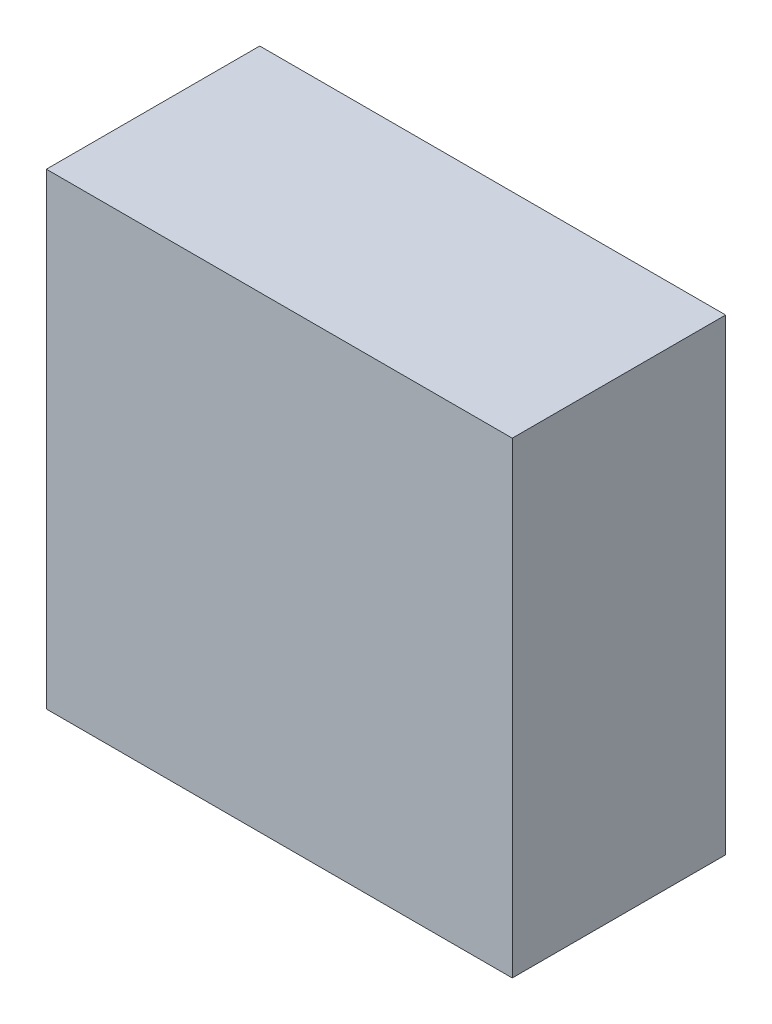
ISO-10303-21;
HEADER;
FILE_DESCRIPTION(('STEP AP214'),'2;1');
FILE_NAME('part.step','',(''),(''),'','','');
FILE_SCHEMA(('AUTOMOTIVE_DESIGN { 1 0 10303 214 1 1 1 1 }'));
ENDSEC;
DATA;
#1=APPLICATION_CONTEXT('core data for automotive mechanical design processes');
#2=APPLICATION_PROTOCOL_DEFINITION('international standard','automotive_design',2000,#1);
#3=PRODUCT_CONTEXT('',#1,'mechanical');
#4=PRODUCT('Part','Part','',(#3));
#5=PRODUCT_RELATED_PRODUCT_CATEGORY('part','',(#4));
#6=PRODUCT_DEFINITION_FORMATION('','',#4);
#7=PRODUCT_DEFINITION_CONTEXT('part definition',#1,'design');
#8=PRODUCT_DEFINITION('design','',#6,#7);
#9=PRODUCT_DEFINITION_SHAPE('','',#8);
#10=(LENGTH_UNIT() NAMED_UNIT(*) SI_UNIT(.MILLI.,.METRE.));
#11=(NAMED_UNIT(*) PLANE_ANGLE_UNIT() SI_UNIT($,.RADIAN.));
#12=(NAMED_UNIT(*) SI_UNIT($,.STERADIAN.) SOLID_ANGLE_UNIT());
#13=UNCERTAINTY_MEASURE_WITH_UNIT(LENGTH_MEASURE(1.E-05),#10,'distance_accuracy_value','');
#14=(GEOMETRIC_REPRESENTATION_CONTEXT(3) GLOBAL_UNCERTAINTY_ASSIGNED_CONTEXT((#13)) GLOBAL_UNIT_ASSIGNED_CONTEXT((#10,
#11,#12)) REPRESENTATION_CONTEXT('',''));
#15=CARTESIAN_POINT('',(0.,0.,0.));
#16=DIRECTION('',(0.,0.,1.));
#17=DIRECTION('',(1.,0.,0.));
#18=AXIS2_PLACEMENT_3D('',#15,#16,#17);
#19=CARTESIAN_POINT('',(0.,7.01223932440552,3.20000000000002));
#20=DIRECTION('',(0.,1.,0.));
#21=DIRECTION('',(-1.,0.,0.));
#22=AXIS2_PLACEMENT_3D('',#19,#20,#21);
#23=PLANE('',#22);
#24=DIRECTION('',(1.,0.,0.));
#25=VECTOR('',#24,1.);
#26=CARTESIAN_POINT('',(0.,7.01223932440553,0.));
#27=LINE('',#26,#25);
#28=CARTESIAN_POINT('',(0.,7.01223932440553,0.));
#29=VERTEX_POINT('',#28);
#30=CARTESIAN_POINT('',(6.98776067565132,7.01223932440553,0.));
#31=VERTEX_POINT('',#30);
#32=EDGE_CURVE('E80',#29,#31,#27,.T.);
#33=ORIENTED_EDGE('',*,*,#32,.F.);
#34=DIRECTION('',(0.,0.,-1.));
#35=VECTOR('',#34,1.);
#36=CARTESIAN_POINT('',(0.,7.01223932440552,3.20000000000002));
#37=LINE('',#36,#35);
#38=CARTESIAN_POINT('',(0.,7.01223932440552,3.20000000000002));
#39=VERTEX_POINT('',#38);
#40=EDGE_CURVE('E10',#39,#29,#37,.T.);
#41=ORIENTED_EDGE('',*,*,#40,.F.);
#42=DIRECTION('',(1.,0.,0.));
#43=VECTOR('',#42,1.);
#44=CARTESIAN_POINT('',(0.,7.01223932440552,3.20000000000002));
#45=LINE('',#44,#43);
#46=CARTESIAN_POINT('',(6.98776067565132,7.01223932440552,3.20000000000002));
#47=VERTEX_POINT('',#46);
#48=EDGE_CURVE('E74',#39,#47,#45,.T.);
#49=ORIENTED_EDGE('',*,*,#48,.T.);
#50=DIRECTION('',(0.,0.,-1.));
#51=VECTOR('',#50,1.);
#52=CARTESIAN_POINT('',(6.98776067565132,7.01223932440552,3.20000000000002));
#53=LINE('',#52,#51);
#54=EDGE_CURVE('E19',#47,#31,#53,.T.);
#55=ORIENTED_EDGE('',*,*,#54,.T.);
#56=EDGE_LOOP('',(#33,#41,#49,#55));
#57=FACE_BOUND('',#56,.T.);
#58=ADVANCED_FACE('F16',(#57),#23,.T.);
#59=CARTESIAN_POINT('',(0.,0.,3.2));
#60=DIRECTION('',(-1.,0.,0.));
#61=DIRECTION('',(0.,-1.,0.));
#62=AXIS2_PLACEMENT_3D('',#59,#60,#61);
#63=PLANE('',#62);
#64=DIRECTION('',(0.,1.,0.));
#65=VECTOR('',#64,1.);
#66=CARTESIAN_POINT('',(0.,0.,0.));
#67=LINE('',#66,#65);
#68=CARTESIAN_POINT('',(0.,0.,0.));
#69=VERTEX_POINT('',#68);
#70=EDGE_CURVE('E76',#69,#29,#67,.T.);
#71=ORIENTED_EDGE('',*,*,#70,.F.);
#72=DIRECTION('',(0.,0.,-1.));
#73=VECTOR('',#72,1.);
#74=CARTESIAN_POINT('',(0.,0.,3.2));
#75=LINE('',#74,#73);
#76=CARTESIAN_POINT('',(0.,0.,3.2));
#77=VERTEX_POINT('',#76);
#78=EDGE_CURVE('E25',#77,#69,#75,.T.);
#79=ORIENTED_EDGE('',*,*,#78,.F.);
#80=DIRECTION('',(0.,1.,0.));
#81=VECTOR('',#80,1.);
#82=CARTESIAN_POINT('',(0.,0.,3.2));
#83=LINE('',#82,#81);
#84=EDGE_CURVE('E64',#77,#39,#83,.T.);
#85=ORIENTED_EDGE('',*,*,#84,.T.);
#86=ORIENTED_EDGE('',*,*,#40,.T.);
#87=EDGE_LOOP('',(#71,#79,#85,#86));
#88=FACE_BOUND('',#87,.T.);
#89=ADVANCED_FACE('F90',(#88),#63,.T.);
#90=CARTESIAN_POINT('',(0.,0.,3.2));
#91=DIRECTION('',(0.,1.,0.));
#92=DIRECTION('',(-1.,0.,0.));
#93=AXIS2_PLACEMENT_3D('',#90,#91,#92);
#94=PLANE('',#93);
#95=DIRECTION('',(1.,0.,0.));
#96=VECTOR('',#95,1.);
#97=CARTESIAN_POINT('',(0.,0.,0.));
#98=LINE('',#97,#96);
#99=CARTESIAN_POINT('',(6.98776067565132,0.,0.));
#100=VERTEX_POINT('',#99);
#101=EDGE_CURVE('E69',#69,#100,#98,.T.);
#102=ORIENTED_EDGE('',*,*,#101,.T.);
#103=DIRECTION('',(0.,0.,-1.));
#104=VECTOR('',#103,1.);
#105=CARTESIAN_POINT('',(6.98776067565132,0.,3.2));
#106=LINE('',#105,#104);
#107=CARTESIAN_POINT('',(6.98776067565132,0.,3.2));
#108=VERTEX_POINT('',#107);
#109=EDGE_CURVE('E67',#108,#100,#106,.T.);
#110=ORIENTED_EDGE('',*,*,#109,.F.);
#111=DIRECTION('',(1.,0.,0.));
#112=VECTOR('',#111,1.);
#113=CARTESIAN_POINT('',(0.,0.,3.2));
#114=LINE('',#113,#112);
#115=EDGE_CURVE('E61',#77,#108,#114,.T.);
#116=ORIENTED_EDGE('',*,*,#115,.F.);
#117=ORIENTED_EDGE('',*,*,#78,.T.);
#118=EDGE_LOOP('',(#102,#110,#116,#117));
#119=FACE_BOUND('',#118,.T.);
#120=ADVANCED_FACE('F68',(#119),#94,.F.);
#121=CARTESIAN_POINT('',(6.98776067565132,0.,3.2));
#122=DIRECTION('',(-1.,0.,0.));
#123=DIRECTION('',(0.,-1.,0.));
#124=AXIS2_PLACEMENT_3D('',#121,#122,#123);
#125=PLANE('',#124);
#126=DIRECTION('',(0.,1.,0.));
#127=VECTOR('',#126,1.);
#128=CARTESIAN_POINT('',(6.98776067565132,0.,0.));
#129=LINE('',#128,#127);
#130=EDGE_CURVE('E83',#100,#31,#129,.T.);
#131=ORIENTED_EDGE('',*,*,#130,.T.);
#132=ORIENTED_EDGE('',*,*,#54,.F.);
#133=DIRECTION('',(0.,1.,0.));
#134=VECTOR('',#133,1.);
#135=CARTESIAN_POINT('',(6.98776067565132,0.,3.2));
#136=LINE('',#135,#134);
#137=EDGE_CURVE('E58',#108,#47,#136,.T.);
#138=ORIENTED_EDGE('',*,*,#137,.F.);
#139=ORIENTED_EDGE('',*,*,#109,.T.);
#140=EDGE_LOOP('',(#131,#132,#138,#139));
#141=FACE_BOUND('',#140,.T.);
#142=ADVANCED_FACE('F73',(#141),#125,.F.);
#143=CARTESIAN_POINT('',(0.,0.,3.2));
#144=DIRECTION('',(0.,0.,1.));
#145=DIRECTION('',(0.,-1.,0.));
#146=AXIS2_PLACEMENT_3D('',#143,#144,#145);
#147=PLANE('',#146);
#148=ORIENTED_EDGE('',*,*,#48,.F.);
#149=ORIENTED_EDGE('',*,*,#84,.F.);
#150=ORIENTED_EDGE('',*,*,#115,.T.);
#151=ORIENTED_EDGE('',*,*,#137,.T.);
#152=EDGE_LOOP('',(#148,#149,#150,#151));
#153=FACE_BOUND('',#152,.T.);
#154=ADVANCED_FACE('F63',(#153),#147,.T.);
#155=CARTESIAN_POINT('',(0.,0.,0.));
#156=DIRECTION('',(0.,0.,1.));
#157=DIRECTION('',(0.,-1.,0.));
#158=AXIS2_PLACEMENT_3D('',#155,#156,#157);
#159=PLANE('',#158);
#160=ORIENTED_EDGE('',*,*,#32,.T.);
#161=ORIENTED_EDGE('',*,*,#130,.F.);
#162=ORIENTED_EDGE('',*,*,#101,.F.);
#163=ORIENTED_EDGE('',*,*,#70,.T.);
#164=EDGE_LOOP('',(#160,#161,#162,#163));
#165=FACE_BOUND('',#164,.T.);
#166=ADVANCED_FACE('F89',(#165),#159,.F.);
#167=CLOSED_SHELL('',(#58,#89,#120,#142,#154,#166));
#168=MANIFOLD_SOLID_BREP('B1',#167);
#169=ADVANCED_BREP_SHAPE_REPRESENTATION('',(#18,#168),#14);
#170=SHAPE_DEFINITION_REPRESENTATION(#9,#169);
ENDSEC;
END-ISO-10303-21;
